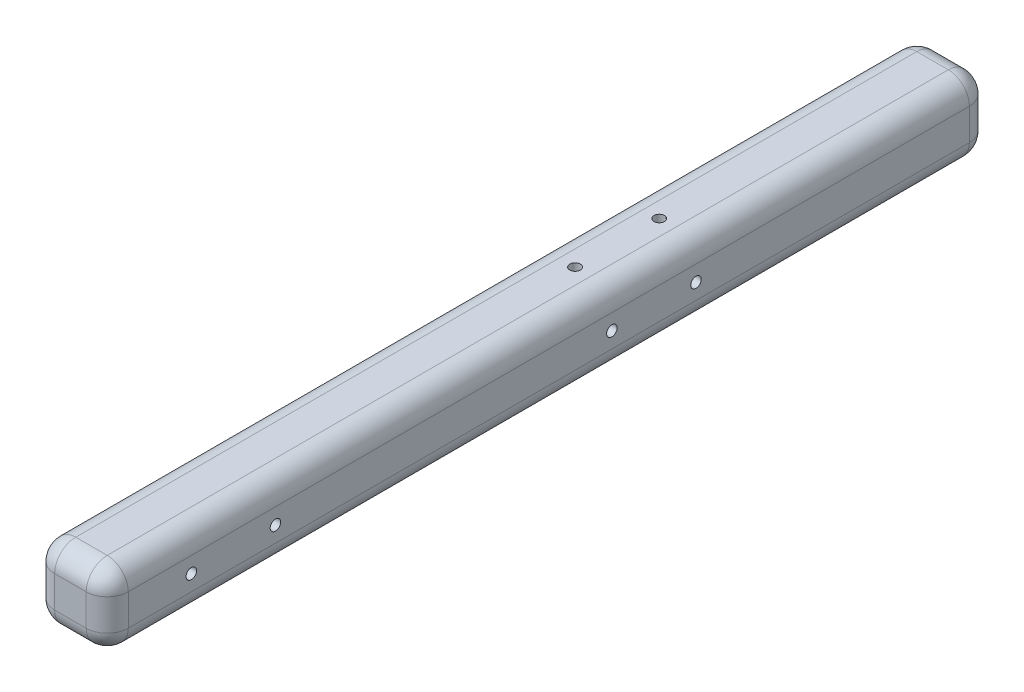
ISO-10303-21;
HEADER;
FILE_DESCRIPTION(('STEP AP214'),'2;1');
FILE_NAME('part.step','',(''),(''),'','','');
FILE_SCHEMA(('AUTOMOTIVE_DESIGN { 1 0 10303 214 1 1 1 1 }'));
ENDSEC;
DATA;
#1=APPLICATION_CONTEXT('core data for automotive mechanical design processes');
#2=APPLICATION_PROTOCOL_DEFINITION('international standard','automotive_design',2000,#1);
#3=PRODUCT_CONTEXT('',#1,'mechanical');
#4=PRODUCT('Part','Part','',(#3));
#5=PRODUCT_RELATED_PRODUCT_CATEGORY('part','',(#4));
#6=PRODUCT_DEFINITION_FORMATION('','',#4);
#7=PRODUCT_DEFINITION_CONTEXT('part definition',#1,'design');
#8=PRODUCT_DEFINITION('design','',#6,#7);
#9=PRODUCT_DEFINITION_SHAPE('','',#8);
#10=(LENGTH_UNIT() NAMED_UNIT(*) SI_UNIT(.MILLI.,.METRE.));
#11=(NAMED_UNIT(*) PLANE_ANGLE_UNIT() SI_UNIT($,.RADIAN.));
#12=(NAMED_UNIT(*) SI_UNIT($,.STERADIAN.) SOLID_ANGLE_UNIT());
#13=UNCERTAINTY_MEASURE_WITH_UNIT(LENGTH_MEASURE(1.E-05),#10,'distance_accuracy_value','');
#14=(GEOMETRIC_REPRESENTATION_CONTEXT(3) GLOBAL_UNCERTAINTY_ASSIGNED_CONTEXT((#13)) GLOBAL_UNIT_ASSIGNED_CONTEXT((#10,
#11,#12)) REPRESENTATION_CONTEXT('',''));
#15=CARTESIAN_POINT('',(0.,0.,0.));
#16=DIRECTION('',(0.,0.,1.));
#17=DIRECTION('',(1.,0.,0.));
#18=AXIS2_PLACEMENT_3D('',#15,#16,#17);
#19=CARTESIAN_POINT('',(-9.525,-9.525,254.));
#20=DIRECTION('',(0.,0.,-1.));
#21=DIRECTION('',(-1.,0.,0.));
#22=AXIS2_PLACEMENT_3D('',#19,#20,#21);
#23=CYLINDRICAL_SURFACE('',#22,12.7);
#24=DIRECTION('',(0.,0.,-1.));
#25=VECTOR('',#24,1.);
#26=CARTESIAN_POINT('',(-9.52499999999991,-22.225,254.));
#27=LINE('',#26,#25);
#28=CARTESIAN_POINT('',(-9.52499999999991,-22.225,520.7));
#29=VERTEX_POINT('',#28);
#30=CARTESIAN_POINT('',(-9.52499999999991,-22.225,12.7));
#31=VERTEX_POINT('',#30);
#32=EDGE_CURVE('E154',#29,#31,#27,.T.);
#33=ORIENTED_EDGE('',*,*,#32,.F.);
#34=CARTESIAN_POINT('',(-9.525,-9.525,520.7));
#35=DIRECTION('',(0.,0.,-1.));
#36=DIRECTION('',(-1.,0.,0.));
#37=AXIS2_PLACEMENT_3D('',#34,#35,#36);
#38=CIRCLE('',#37,12.7);
#39=CARTESIAN_POINT('',(-22.225,-9.52499999999991,520.7));
#40=VERTEX_POINT('',#39);
#41=EDGE_CURVE('E214',#29,#40,#38,.T.);
#42=ORIENTED_EDGE('',*,*,#41,.T.);
#43=DIRECTION('',(0.,0.,-1.));
#44=VECTOR('',#43,1.);
#45=CARTESIAN_POINT('',(-22.225,-9.52499999999991,254.));
#46=LINE('',#45,#44);
#47=CARTESIAN_POINT('',(-22.225,-9.52499999999991,12.7));
#48=VERTEX_POINT('',#47);
#49=EDGE_CURVE('E200',#40,#48,#46,.T.);
#50=ORIENTED_EDGE('',*,*,#49,.T.);
#51=CARTESIAN_POINT('',(-9.525,-9.525,12.7));
#52=DIRECTION('',(0.,0.,-1.));
#53=DIRECTION('',(-1.,0.,0.));
#54=AXIS2_PLACEMENT_3D('',#51,#52,#53);
#55=CIRCLE('',#54,12.7);
#56=EDGE_CURVE('E176',#48,#31,#55,.F.);
#57=ORIENTED_EDGE('',*,*,#56,.T.);
#58=EDGE_LOOP('',(#33,#42,#50,#57));
#59=FACE_BOUND('',#58,.T.);
#60=ADVANCED_FACE('F32',(#59),#23,.T.);
#61=CARTESIAN_POINT('',(-9.52499999999991,-22.225,254.));
#62=DIRECTION('',(0.,1.,0.));
#63=DIRECTION('',(0.,0.,1.));
#64=AXIS2_PLACEMENT_3D('',#61,#62,#63);
#65=PLANE('',#64);
#66=DIRECTION('',(0.,0.,-1.));
#67=VECTOR('',#66,1.);
#68=CARTESIAN_POINT('',(9.52499999999991,-22.225,254.));
#69=LINE('',#68,#67);
#70=CARTESIAN_POINT('',(9.52499999999991,-22.225,520.7));
#71=VERTEX_POINT('',#70);
#72=CARTESIAN_POINT('',(9.52499999999991,-22.225,12.7));
#73=VERTEX_POINT('',#72);
#74=EDGE_CURVE('E158',#71,#73,#69,.T.);
#75=ORIENTED_EDGE('',*,*,#74,.F.);
#76=DIRECTION('',(1.,0.,0.));
#77=VECTOR('',#76,1.);
#78=CARTESIAN_POINT('',(-9.52499999999991,-22.225,520.7));
#79=LINE('',#78,#77);
#80=EDGE_CURVE('E212',#71,#29,#79,.F.);
#81=ORIENTED_EDGE('',*,*,#80,.T.);
#82=ORIENTED_EDGE('',*,*,#32,.T.);
#83=DIRECTION('',(1.,0.,0.));
#84=VECTOR('',#83,1.);
#85=CARTESIAN_POINT('',(9.52499999999991,-22.225,12.7));
#86=LINE('',#85,#84);
#87=EDGE_CURVE('E173',#31,#73,#86,.T.);
#88=ORIENTED_EDGE('',*,*,#87,.T.);
#89=EDGE_LOOP('',(#75,#81,#82,#88));
#90=FACE_BOUND('',#89,.T.);
#91=ADVANCED_FACE('F287',(#90),#65,.F.);
#92=CARTESIAN_POINT('',(9.525,-9.525,254.));
#93=DIRECTION('',(0.,0.,-1.));
#94=DIRECTION('',(-1.,0.,0.));
#95=AXIS2_PLACEMENT_3D('',#92,#93,#94);
#96=CYLINDRICAL_SURFACE('',#95,12.7);
#97=DIRECTION('',(0.,0.,-1.));
#98=VECTOR('',#97,1.);
#99=CARTESIAN_POINT('',(22.225,-9.52499999999991,254.));
#100=LINE('',#99,#98);
#101=CARTESIAN_POINT('',(22.225,-9.52499999999991,520.7));
#102=VERTEX_POINT('',#101);
#103=CARTESIAN_POINT('',(22.225,-9.52499999999991,12.7));
#104=VERTEX_POINT('',#103);
#105=EDGE_CURVE('E276',#102,#104,#100,.T.);
#106=ORIENTED_EDGE('',*,*,#105,.F.);
#107=CARTESIAN_POINT('',(9.525,-9.525,520.7));
#108=DIRECTION('',(0.,0.,-1.));
#109=DIRECTION('',(-1.,0.,0.));
#110=AXIS2_PLACEMENT_3D('',#107,#108,#109);
#111=CIRCLE('',#110,12.7);
#112=EDGE_CURVE('E148',#102,#71,#111,.T.);
#113=ORIENTED_EDGE('',*,*,#112,.T.);
#114=ORIENTED_EDGE('',*,*,#74,.T.);
#115=CARTESIAN_POINT('',(9.525,-9.525,12.7));
#116=DIRECTION('',(0.,0.,-1.));
#117=DIRECTION('',(-1.,0.,0.));
#118=AXIS2_PLACEMENT_3D('',#115,#116,#117);
#119=CIRCLE('',#118,12.7);
#120=EDGE_CURVE('E170',#73,#104,#119,.F.);
#121=ORIENTED_EDGE('',*,*,#120,.T.);
#122=EDGE_LOOP('',(#106,#113,#114,#121));
#123=FACE_BOUND('',#122,.T.);
#124=ADVANCED_FACE('F280',(#123),#96,.T.);
#125=CARTESIAN_POINT('',(22.225,-9.52499999999991,254.));
#126=DIRECTION('',(-1.,0.,0.));
#127=DIRECTION('',(0.,0.,1.));
#128=AXIS2_PLACEMENT_3D('',#125,#126,#127);
#129=PLANE('',#128);
#130=CARTESIAN_POINT('',(22.225,0.,431.800000000005));
#131=DIRECTION('',(1.,0.,0.));
#132=DIRECTION('',(0.,0.,-1.));
#133=AXIS2_PLACEMENT_3D('',#130,#131,#132);
#134=CIRCLE('',#133,3.17499999999997);
#135=CARTESIAN_POINT('',(22.225,0.,428.625000000005));
#136=VERTEX_POINT('',#135);
#137=EDGE_CURVE('E721',#136,#136,#134,.T.);
#138=ORIENTED_EDGE('',*,*,#137,.F.);
#139=EDGE_LOOP('',(#138));
#140=FACE_BOUND('',#139,.T.);
#141=CARTESIAN_POINT('',(22.225,0.,482.599999999995));
#142=DIRECTION('',(1.,0.,0.));
#143=DIRECTION('',(0.,0.,-1.));
#144=AXIS2_PLACEMENT_3D('',#141,#142,#143);
#145=CIRCLE('',#144,3.17499999999997);
#146=CARTESIAN_POINT('',(22.225,0.,479.424999999995));
#147=VERTEX_POINT('',#146);
#148=EDGE_CURVE('E715',#147,#147,#145,.T.);
#149=ORIENTED_EDGE('',*,*,#148,.F.);
#150=EDGE_LOOP('',(#149));
#151=FACE_BOUND('',#150,.T.);
#152=CARTESIAN_POINT('',(22.2250000000006,6.01007305568305E-13,177.799999999995));
#153=DIRECTION('',(1.,0.,0.));
#154=DIRECTION('',(0.,0.,1.));
#155=AXIS2_PLACEMENT_3D('',#152,#153,#154);
#156=CIRCLE('',#155,3.175);
#157=CARTESIAN_POINT('',(22.2250000000006,6.12092758819132E-13,180.974999999995));
#158=VERTEX_POINT('',#157);
#159=EDGE_CURVE('E255',#158,#158,#156,.T.);
#160=ORIENTED_EDGE('',*,*,#159,.F.);
#161=EDGE_LOOP('',(#160));
#162=FACE_BOUND('',#161,.T.);
#163=CARTESIAN_POINT('',(22.2250000000008,6.89690931574916E-13,228.6));
#164=DIRECTION('',(1.,0.,0.));
#165=DIRECTION('',(0.,0.,1.));
#166=AXIS2_PLACEMENT_3D('',#163,#164,#165);
#167=CIRCLE('',#166,3.175);
#168=CARTESIAN_POINT('',(22.2250000000008,7.00776384825743E-13,231.775));
#169=VERTEX_POINT('',#168);
#170=EDGE_CURVE('E245',#169,#169,#167,.T.);
#171=ORIENTED_EDGE('',*,*,#170,.F.);
#172=EDGE_LOOP('',(#171));
#173=FACE_BOUND('',#172,.T.);
#174=DIRECTION('',(0.,0.,-1.));
#175=VECTOR('',#174,1.);
#176=CARTESIAN_POINT('',(22.225,9.52499999999991,254.));
#177=LINE('',#176,#175);
#178=CARTESIAN_POINT('',(22.225,9.52499999999991,520.7));
#179=VERTEX_POINT('',#178);
#180=CARTESIAN_POINT('',(22.225,9.52499999999991,12.7));
#181=VERTEX_POINT('',#180);
#182=EDGE_CURVE('E128',#179,#181,#177,.T.);
#183=ORIENTED_EDGE('',*,*,#182,.F.);
#184=DIRECTION('',(0.,1.,0.));
#185=VECTOR('',#184,1.);
#186=CARTESIAN_POINT('',(22.225,-9.52499999999991,520.7));
#187=LINE('',#186,#185);
#188=EDGE_CURVE('E11',#179,#102,#187,.F.);
#189=ORIENTED_EDGE('',*,*,#188,.T.);
#190=ORIENTED_EDGE('',*,*,#105,.T.);
#191=DIRECTION('',(0.,1.,0.));
#192=VECTOR('',#191,1.);
#193=CARTESIAN_POINT('',(22.225,9.52499999999991,12.7));
#194=LINE('',#193,#192);
#195=EDGE_CURVE('E153',#104,#181,#194,.T.);
#196=ORIENTED_EDGE('',*,*,#195,.T.);
#197=EDGE_LOOP('',(#183,#189,#190,#196));
#198=FACE_BOUND('',#197,.T.);
#199=ADVANCED_FACE('F299',(#140,#151,#162,#173,#198),#129,.F.);
#200=CARTESIAN_POINT('',(9.525,9.525,254.));
#201=DIRECTION('',(0.,0.,-1.));
#202=DIRECTION('',(-1.,0.,0.));
#203=AXIS2_PLACEMENT_3D('',#200,#201,#202);
#204=CYLINDRICAL_SURFACE('',#203,12.7);
#205=DIRECTION('',(0.,0.,-1.));
#206=VECTOR('',#205,1.);
#207=CARTESIAN_POINT('',(9.52499999999991,22.225,254.));
#208=LINE('',#207,#206);
#209=CARTESIAN_POINT('',(9.52499999999991,22.225,520.7));
#210=VERTEX_POINT('',#209);
#211=CARTESIAN_POINT('',(9.52499999999991,22.225,12.7));
#212=VERTEX_POINT('',#211);
#213=EDGE_CURVE('E120',#210,#212,#208,.T.);
#214=ORIENTED_EDGE('',*,*,#213,.F.);
#215=CARTESIAN_POINT('',(9.525,9.525,520.7));
#216=DIRECTION('',(0.,0.,-1.));
#217=DIRECTION('',(-1.,0.,0.));
#218=AXIS2_PLACEMENT_3D('',#215,#216,#217);
#219=CIRCLE('',#218,12.7);
#220=EDGE_CURVE('E41',#210,#179,#219,.T.);
#221=ORIENTED_EDGE('',*,*,#220,.T.);
#222=ORIENTED_EDGE('',*,*,#182,.T.);
#223=CARTESIAN_POINT('',(9.525,9.525,12.7));
#224=DIRECTION('',(0.,0.,-1.));
#225=DIRECTION('',(-1.,0.,0.));
#226=AXIS2_PLACEMENT_3D('',#223,#224,#225);
#227=CIRCLE('',#226,12.7);
#228=EDGE_CURVE('E137',#181,#212,#227,.F.);
#229=ORIENTED_EDGE('',*,*,#228,.T.);
#230=EDGE_LOOP('',(#214,#221,#222,#229));
#231=FACE_BOUND('',#230,.T.);
#232=ADVANCED_FACE('F151',(#231),#204,.T.);
#233=CARTESIAN_POINT('',(-9.52499999999991,22.225,254.));
#234=DIRECTION('',(0.,-1.,0.));
#235=DIRECTION('',(0.,0.,-1.));
#236=AXIS2_PLACEMENT_3D('',#233,#234,#235);
#237=PLANE('',#236);
#238=CARTESIAN_POINT('',(0.,22.225,177.799999999995));
#239=DIRECTION('',(0.,1.,0.));
#240=DIRECTION('',(0.,0.,1.));
#241=AXIS2_PLACEMENT_3D('',#238,#239,#240);
#242=CIRCLE('',#241,3.175);
#243=CARTESIAN_POINT('',(0.,22.225,180.974999999995));
#244=VERTEX_POINT('',#243);
#245=EDGE_CURVE('E261',#244,#244,#242,.T.);
#246=ORIENTED_EDGE('',*,*,#245,.F.);
#247=EDGE_LOOP('',(#246));
#248=FACE_BOUND('',#247,.T.);
#249=CARTESIAN_POINT('',(0.,22.225,228.6));
#250=DIRECTION('',(0.,1.,0.));
#251=DIRECTION('',(0.,0.,1.));
#252=AXIS2_PLACEMENT_3D('',#249,#250,#251);
#253=CIRCLE('',#252,3.175);
#254=CARTESIAN_POINT('',(0.,22.225,231.775));
#255=VERTEX_POINT('',#254);
#256=EDGE_CURVE('E267',#255,#255,#253,.T.);
#257=ORIENTED_EDGE('',*,*,#256,.F.);
#258=EDGE_LOOP('',(#257));
#259=FACE_BOUND('',#258,.T.);
#260=DIRECTION('',(0.,0.,-1.));
#261=VECTOR('',#260,1.);
#262=CARTESIAN_POINT('',(-9.52499999999991,22.225,254.));
#263=LINE('',#262,#261);
#264=CARTESIAN_POINT('',(-9.52499999999991,22.225,520.7));
#265=VERTEX_POINT('',#264);
#266=CARTESIAN_POINT('',(-9.52499999999991,22.225,12.7));
#267=VERTEX_POINT('',#266);
#268=EDGE_CURVE('E129',#265,#267,#263,.T.);
#269=ORIENTED_EDGE('',*,*,#268,.F.);
#270=DIRECTION('',(-1.,0.,0.));
#271=VECTOR('',#270,1.);
#272=CARTESIAN_POINT('',(-9.52499999999991,22.225,520.7));
#273=LINE('',#272,#271);
#274=EDGE_CURVE('E56',#265,#210,#273,.F.);
#275=ORIENTED_EDGE('',*,*,#274,.T.);
#276=ORIENTED_EDGE('',*,*,#213,.T.);
#277=DIRECTION('',(-1.,0.,0.));
#278=VECTOR('',#277,1.);
#279=CARTESIAN_POINT('',(-9.52499999999991,22.225,12.7));
#280=LINE('',#279,#278);
#281=EDGE_CURVE('E124',#212,#267,#280,.T.);
#282=ORIENTED_EDGE('',*,*,#281,.T.);
#283=EDGE_LOOP('',(#269,#275,#276,#282));
#284=FACE_BOUND('',#283,.T.);
#285=ADVANCED_FACE('F122',(#248,#259,#284),#237,.F.);
#286=CARTESIAN_POINT('',(-9.525,9.525,254.));
#287=DIRECTION('',(0.,0.,-1.));
#288=DIRECTION('',(-1.,0.,0.));
#289=AXIS2_PLACEMENT_3D('',#286,#287,#288);
#290=CYLINDRICAL_SURFACE('',#289,12.7);
#291=DIRECTION('',(0.,0.,-1.));
#292=VECTOR('',#291,1.);
#293=CARTESIAN_POINT('',(-22.225,9.52499999999991,254.));
#294=LINE('',#293,#292);
#295=CARTESIAN_POINT('',(-22.225,9.52499999999991,520.7));
#296=VERTEX_POINT('',#295);
#297=CARTESIAN_POINT('',(-22.225,9.52499999999991,12.7));
#298=VERTEX_POINT('',#297);
#299=EDGE_CURVE('E272',#296,#298,#294,.T.);
#300=ORIENTED_EDGE('',*,*,#299,.F.);
#301=CARTESIAN_POINT('',(-9.525,9.525,520.7));
#302=DIRECTION('',(0.,0.,-1.));
#303=DIRECTION('',(-1.,0.,0.));
#304=AXIS2_PLACEMENT_3D('',#301,#302,#303);
#305=CIRCLE('',#304,12.7);
#306=EDGE_CURVE('E218',#296,#265,#305,.T.);
#307=ORIENTED_EDGE('',*,*,#306,.T.);
#308=ORIENTED_EDGE('',*,*,#268,.T.);
#309=CARTESIAN_POINT('',(-9.525,9.525,12.7));
#310=DIRECTION('',(0.,0.,-1.));
#311=DIRECTION('',(-1.,0.,0.));
#312=AXIS2_PLACEMENT_3D('',#309,#310,#311);
#313=CIRCLE('',#312,12.7);
#314=EDGE_CURVE('E149',#267,#298,#313,.F.);
#315=ORIENTED_EDGE('',*,*,#314,.T.);
#316=EDGE_LOOP('',(#300,#307,#308,#315));
#317=FACE_BOUND('',#316,.T.);
#318=ADVANCED_FACE('F330',(#317),#290,.T.);
#319=CARTESIAN_POINT('',(-22.225,-9.52499999999991,254.));
#320=DIRECTION('',(1.,0.,0.));
#321=DIRECTION('',(0.,0.,-1.));
#322=AXIS2_PLACEMENT_3D('',#319,#320,#321);
#323=PLANE('',#322);
#324=ORIENTED_EDGE('',*,*,#49,.F.);
#325=DIRECTION('',(0.,-1.,0.));
#326=VECTOR('',#325,1.);
#327=CARTESIAN_POINT('',(-22.225,-9.52499999999991,520.7));
#328=LINE('',#327,#326);
#329=EDGE_CURVE('E216',#40,#296,#328,.F.);
#330=ORIENTED_EDGE('',*,*,#329,.T.);
#331=ORIENTED_EDGE('',*,*,#299,.T.);
#332=DIRECTION('',(0.,-1.,0.));
#333=VECTOR('',#332,1.);
#334=CARTESIAN_POINT('',(-22.225,-9.52499999999991,12.7));
#335=LINE('',#334,#333);
#336=EDGE_CURVE('E179',#298,#48,#335,.T.);
#337=ORIENTED_EDGE('',*,*,#336,.T.);
#338=EDGE_LOOP('',(#324,#330,#331,#337));
#339=FACE_BOUND('',#338,.T.);
#340=ADVANCED_FACE('F327',(#339),#323,.F.);
#341=CARTESIAN_POINT('',(-9.525,-9.525,0.));
#342=DIRECTION('',(0.,0.,-1.));
#343=DIRECTION('',(-1.,0.,0.));
#344=AXIS2_PLACEMENT_3D('',#341,#342,#343);
#345=PLANE('',#344);
#346=DIRECTION('',(-1.,0.,0.));
#347=VECTOR('',#346,1.);
#348=CARTESIAN_POINT('',(9.52499999999991,9.525,0.));
#349=LINE('',#348,#347);
#350=CARTESIAN_POINT('',(-9.525,9.525,0.));
#351=VERTEX_POINT('',#350);
#352=CARTESIAN_POINT('',(9.525,9.525,0.));
#353=VERTEX_POINT('',#352);
#354=EDGE_CURVE('E156',#351,#353,#349,.F.);
#355=ORIENTED_EDGE('',*,*,#354,.T.);
#356=DIRECTION('',(0.,1.,0.));
#357=VECTOR('',#356,1.);
#358=CARTESIAN_POINT('',(9.525,-9.52499999999991,0.));
#359=LINE('',#358,#357);
#360=CARTESIAN_POINT('',(9.525,-9.525,0.));
#361=VERTEX_POINT('',#360);
#362=EDGE_CURVE('E167',#353,#361,#359,.F.);
#363=ORIENTED_EDGE('',*,*,#362,.T.);
#364=DIRECTION('',(1.,0.,0.));
#365=VECTOR('',#364,1.);
#366=CARTESIAN_POINT('',(-9.52499999999991,-9.525,0.));
#367=LINE('',#366,#365);
#368=CARTESIAN_POINT('',(-9.525,-9.525,0.));
#369=VERTEX_POINT('',#368);
#370=EDGE_CURVE('E165',#361,#369,#367,.F.);
#371=ORIENTED_EDGE('',*,*,#370,.T.);
#372=DIRECTION('',(0.,-1.,0.));
#373=VECTOR('',#372,1.);
#374=CARTESIAN_POINT('',(-9.525,9.52499999999992,0.));
#375=LINE('',#374,#373);
#376=EDGE_CURVE('E163',#369,#351,#375,.F.);
#377=ORIENTED_EDGE('',*,*,#376,.T.);
#378=EDGE_LOOP('',(#355,#363,#371,#377));
#379=FACE_BOUND('',#378,.T.);
#380=ADVANCED_FACE('F374',(#379),#345,.T.);
#381=CARTESIAN_POINT('',(-9.525,-9.525,12.7));
#382=DIRECTION('',(0.,0.,-1.));
#383=DIRECTION('',(-1.,0.,0.));
#384=AXIS2_PLACEMENT_3D('',#381,#382,#383);
#385=SPHERICAL_SURFACE('',#384,12.7);
#386=CARTESIAN_POINT('',(-9.525,-9.525,12.7));
#387=DIRECTION('',(0.,1.,0.));
#388=DIRECTION('',(-1.,0.,0.));
#389=AXIS2_PLACEMENT_3D('',#386,#387,#388);
#390=CIRCLE('',#389,12.7);
#391=EDGE_CURVE('E194',#369,#48,#390,.T.);
#392=ORIENTED_EDGE('',*,*,#391,.F.);
#393=CARTESIAN_POINT('',(-9.525,-9.525,12.7));
#394=DIRECTION('',(1.,0.,0.));
#395=DIRECTION('',(0.,1.,0.));
#396=AXIS2_PLACEMENT_3D('',#393,#394,#395);
#397=CIRCLE('',#396,12.7);
#398=EDGE_CURVE('E197',#31,#369,#397,.T.);
#399=ORIENTED_EDGE('',*,*,#398,.F.);
#400=ORIENTED_EDGE('',*,*,#56,.F.);
#401=EDGE_LOOP('',(#392,#399,#400));
#402=FACE_BOUND('',#401,.T.);
#403=ADVANCED_FACE('F371',(#402),#385,.T.);
#404=CARTESIAN_POINT('',(-9.52499999999991,-9.525,12.7));
#405=DIRECTION('',(-1.,0.,0.));
#406=DIRECTION('',(0.,0.,1.));
#407=AXIS2_PLACEMENT_3D('',#404,#405,#406);
#408=CYLINDRICAL_SURFACE('',#407,12.7);
#409=ORIENTED_EDGE('',*,*,#398,.T.);
#410=ORIENTED_EDGE('',*,*,#370,.F.);
#411=CARTESIAN_POINT('',(9.52499999999991,-9.525,12.7));
#412=DIRECTION('',(1.,0.,0.));
#413=DIRECTION('',(0.,0.,-1.));
#414=AXIS2_PLACEMENT_3D('',#411,#412,#413);
#415=CIRCLE('',#414,12.7);
#416=EDGE_CURVE('E191',#73,#361,#415,.T.);
#417=ORIENTED_EDGE('',*,*,#416,.F.);
#418=ORIENTED_EDGE('',*,*,#87,.F.);
#419=EDGE_LOOP('',(#409,#410,#417,#418));
#420=FACE_BOUND('',#419,.T.);
#421=ADVANCED_FACE('F291',(#420),#408,.T.);
#422=CARTESIAN_POINT('',(-9.525,-9.52499999999991,12.7));
#423=DIRECTION('',(0.,1.,0.));
#424=DIRECTION('',(0.,0.,1.));
#425=AXIS2_PLACEMENT_3D('',#422,#423,#424);
#426=CYLINDRICAL_SURFACE('',#425,12.7);
#427=ORIENTED_EDGE('',*,*,#391,.T.);
#428=ORIENTED_EDGE('',*,*,#336,.F.);
#429=CARTESIAN_POINT('',(-9.525,9.52499999999991,12.7));
#430=DIRECTION('',(0.,1.,0.));
#431=DIRECTION('',(0.,0.,1.));
#432=AXIS2_PLACEMENT_3D('',#429,#430,#431);
#433=CIRCLE('',#432,12.7);
#434=EDGE_CURVE('E188',#351,#298,#433,.T.);
#435=ORIENTED_EDGE('',*,*,#434,.F.);
#436=ORIENTED_EDGE('',*,*,#376,.F.);
#437=EDGE_LOOP('',(#427,#428,#435,#436));
#438=FACE_BOUND('',#437,.T.);
#439=ADVANCED_FACE('F365',(#438),#426,.T.);
#440=CARTESIAN_POINT('',(9.525,-9.525,12.7));
#441=DIRECTION('',(0.,0.,-1.));
#442=DIRECTION('',(-1.,0.,0.));
#443=AXIS2_PLACEMENT_3D('',#440,#441,#442);
#444=SPHERICAL_SURFACE('',#443,12.7);
#445=ORIENTED_EDGE('',*,*,#120,.F.);
#446=ORIENTED_EDGE('',*,*,#416,.T.);
#447=CARTESIAN_POINT('',(9.525,-9.525,12.7));
#448=DIRECTION('',(0.,1.,0.));
#449=DIRECTION('',(-1.,0.,0.));
#450=AXIS2_PLACEMENT_3D('',#447,#448,#449);
#451=CIRCLE('',#450,12.7);
#452=EDGE_CURVE('E186',#104,#361,#451,.T.);
#453=ORIENTED_EDGE('',*,*,#452,.F.);
#454=EDGE_LOOP('',(#445,#446,#453));
#455=FACE_BOUND('',#454,.T.);
#456=ADVANCED_FACE('F293',(#455),#444,.T.);
#457=CARTESIAN_POINT('',(-9.525,9.525,12.7));
#458=DIRECTION('',(0.,0.,-1.));
#459=DIRECTION('',(-1.,0.,0.));
#460=AXIS2_PLACEMENT_3D('',#457,#458,#459);
#461=SPHERICAL_SURFACE('',#460,12.7);
#462=ORIENTED_EDGE('',*,*,#434,.T.);
#463=ORIENTED_EDGE('',*,*,#314,.F.);
#464=CARTESIAN_POINT('',(-9.525,9.525,12.7));
#465=DIRECTION('',(1.,0.,0.));
#466=DIRECTION('',(0.,1.,0.));
#467=AXIS2_PLACEMENT_3D('',#464,#465,#466);
#468=CIRCLE('',#467,12.7);
#469=EDGE_CURVE('E147',#351,#267,#468,.T.);
#470=ORIENTED_EDGE('',*,*,#469,.F.);
#471=EDGE_LOOP('',(#462,#463,#470));
#472=FACE_BOUND('',#471,.T.);
#473=ADVANCED_FACE('F359',(#472),#461,.T.);
#474=CARTESIAN_POINT('',(9.525,-9.52499999999991,12.7));
#475=DIRECTION('',(0.,-1.,0.));
#476=DIRECTION('',(0.,0.,-1.));
#477=AXIS2_PLACEMENT_3D('',#474,#475,#476);
#478=CYLINDRICAL_SURFACE('',#477,12.7);
#479=ORIENTED_EDGE('',*,*,#452,.T.);
#480=ORIENTED_EDGE('',*,*,#362,.F.);
#481=CARTESIAN_POINT('',(9.525,9.52499999999991,12.7));
#482=DIRECTION('',(0.,1.,0.));
#483=DIRECTION('',(0.,0.,1.));
#484=AXIS2_PLACEMENT_3D('',#481,#482,#483);
#485=CIRCLE('',#484,12.7);
#486=EDGE_CURVE('E139',#181,#353,#485,.T.);
#487=ORIENTED_EDGE('',*,*,#486,.F.);
#488=ORIENTED_EDGE('',*,*,#195,.F.);
#489=EDGE_LOOP('',(#479,#480,#487,#488));
#490=FACE_BOUND('',#489,.T.);
#491=ADVANCED_FACE('F297',(#490),#478,.T.);
#492=CARTESIAN_POINT('',(-9.52499999999991,9.525,12.7));
#493=DIRECTION('',(1.,0.,0.));
#494=DIRECTION('',(0.,0.,-1.));
#495=AXIS2_PLACEMENT_3D('',#492,#493,#494);
#496=CYLINDRICAL_SURFACE('',#495,12.7);
#497=ORIENTED_EDGE('',*,*,#469,.T.);
#498=ORIENTED_EDGE('',*,*,#281,.F.);
#499=CARTESIAN_POINT('',(9.525,9.525,12.7));
#500=DIRECTION('',(1.,0.,0.));
#501=DIRECTION('',(0.,1.,0.));
#502=AXIS2_PLACEMENT_3D('',#499,#500,#501);
#503=CIRCLE('',#502,12.7);
#504=EDGE_CURVE('E135',#353,#212,#503,.T.);
#505=ORIENTED_EDGE('',*,*,#504,.F.);
#506=ORIENTED_EDGE('',*,*,#354,.F.);
#507=EDGE_LOOP('',(#497,#498,#505,#506));
#508=FACE_BOUND('',#507,.T.);
#509=ADVANCED_FACE('F145',(#508),#496,.T.);
#510=CARTESIAN_POINT('',(9.525,9.525,12.7));
#511=DIRECTION('',(0.,0.,-1.));
#512=DIRECTION('',(-1.,0.,0.));
#513=AXIS2_PLACEMENT_3D('',#510,#511,#512);
#514=SPHERICAL_SURFACE('',#513,12.7);
#515=ORIENTED_EDGE('',*,*,#228,.F.);
#516=ORIENTED_EDGE('',*,*,#486,.T.);
#517=ORIENTED_EDGE('',*,*,#504,.T.);
#518=EDGE_LOOP('',(#515,#516,#517));
#519=FACE_BOUND('',#518,.T.);
#520=ADVANCED_FACE('F136',(#519),#514,.T.);
#521=CARTESIAN_POINT('',(0.,9.525,228.6));
#522=DIRECTION('',(0.,1.,0.));
#523=DIRECTION('',(0.,0.,1.));
#524=AXIS2_PLACEMENT_3D('',#521,#522,#523);
#525=CYLINDRICAL_SURFACE('',#524,3.175);
#526=CARTESIAN_POINT('',(0.,9.525,228.6));
#527=DIRECTION('',(0.,1.,0.));
#528=DIRECTION('',(0.,0.,1.));
#529=AXIS2_PLACEMENT_3D('',#526,#527,#528);
#530=CIRCLE('',#529,3.175);
#531=CARTESIAN_POINT('',(0.,9.525,231.775));
#532=VERTEX_POINT('',#531);
#533=EDGE_CURVE('E264',#532,#532,#530,.T.);
#534=ORIENTED_EDGE('',*,*,#533,.F.);
#535=EDGE_LOOP('',(#534));
#536=FACE_BOUND('',#535,.T.);
#537=ORIENTED_EDGE('',*,*,#256,.T.);
#538=EDGE_LOOP('',(#537));
#539=FACE_BOUND('',#538,.T.);
#540=ADVANCED_FACE('F354',(#536,#539),#525,.F.);
#541=CARTESIAN_POINT('',(0.,9.525,228.6));
#542=DIRECTION('',(0.,1.,0.));
#543=DIRECTION('',(0.,0.,1.));
#544=AXIS2_PLACEMENT_3D('',#541,#542,#543);
#545=PLANE('',#544);
#546=ORIENTED_EDGE('',*,*,#533,.T.);
#547=EDGE_LOOP('',(#546));
#548=FACE_BOUND('',#547,.T.);
#549=ADVANCED_FACE('F601',(#548),#545,.T.);
#550=CARTESIAN_POINT('',(0.,9.525,177.799999999995));
#551=DIRECTION('',(0.,1.,0.));
#552=DIRECTION('',(0.,0.,1.));
#553=AXIS2_PLACEMENT_3D('',#550,#551,#552);
#554=CYLINDRICAL_SURFACE('',#553,3.175);
#555=CARTESIAN_POINT('',(0.,9.525,177.799999999995));
#556=DIRECTION('',(0.,1.,0.));
#557=DIRECTION('',(0.,0.,1.));
#558=AXIS2_PLACEMENT_3D('',#555,#556,#557);
#559=CIRCLE('',#558,3.175);
#560=CARTESIAN_POINT('',(0.,9.525,180.974999999995));
#561=VERTEX_POINT('',#560);
#562=EDGE_CURVE('E142',#561,#561,#559,.T.);
#563=ORIENTED_EDGE('',*,*,#562,.F.);
#564=EDGE_LOOP('',(#563));
#565=FACE_BOUND('',#564,.T.);
#566=ORIENTED_EDGE('',*,*,#245,.T.);
#567=EDGE_LOOP('',(#566));
#568=FACE_BOUND('',#567,.T.);
#569=ADVANCED_FACE('F592',(#565,#568),#554,.F.);
#570=CARTESIAN_POINT('',(0.,9.525,177.799999999995));
#571=DIRECTION('',(0.,1.,0.));
#572=DIRECTION('',(0.,0.,1.));
#573=AXIS2_PLACEMENT_3D('',#570,#571,#572);
#574=PLANE('',#573);
#575=ORIENTED_EDGE('',*,*,#562,.T.);
#576=EDGE_LOOP('',(#575));
#577=FACE_BOUND('',#576,.T.);
#578=ADVANCED_FACE('F583',(#577),#574,.T.);
#579=CARTESIAN_POINT('',(9.5250000000008,7.34032744578224E-13,228.6));
#580=DIRECTION('',(1.,0.,0.));
#581=DIRECTION('',(0.,1.,0.));
#582=AXIS2_PLACEMENT_3D('',#579,#580,#581);
#583=CYLINDRICAL_SURFACE('',#582,3.175);
#584=CARTESIAN_POINT('',(9.5250000000008,7.34032744578224E-13,228.6));
#585=DIRECTION('',(1.,0.,0.));
#586=DIRECTION('',(0.,0.,1.));
#587=AXIS2_PLACEMENT_3D('',#584,#585,#586);
#588=CIRCLE('',#587,3.175);
#589=CARTESIAN_POINT('',(9.52500000000081,7.45118197829051E-13,231.775));
#590=VERTEX_POINT('',#589);
#591=EDGE_CURVE('E250',#590,#590,#588,.T.);
#592=ORIENTED_EDGE('',*,*,#591,.F.);
#593=EDGE_LOOP('',(#592));
#594=FACE_BOUND('',#593,.T.);
#595=ORIENTED_EDGE('',*,*,#170,.T.);
#596=EDGE_LOOP('',(#595));
#597=FACE_BOUND('',#596,.T.);
#598=ADVANCED_FACE('F574',(#594,#597),#583,.F.);
#599=CARTESIAN_POINT('',(9.5250000000008,7.34032744578224E-13,228.6));
#600=DIRECTION('',(1.,0.,0.));
#601=DIRECTION('',(0.,0.,1.));
#602=AXIS2_PLACEMENT_3D('',#599,#600,#601);
#603=PLANE('',#602);
#604=ORIENTED_EDGE('',*,*,#591,.T.);
#605=EDGE_LOOP('',(#604));
#606=FACE_BOUND('',#605,.T.);
#607=ADVANCED_FACE('F565',(#606),#603,.T.);
#608=CARTESIAN_POINT('',(9.52500000000062,6.45349118571612E-13,177.799999999995));
#609=DIRECTION('',(1.,0.,0.));
#610=DIRECTION('',(0.,1.,0.));
#611=AXIS2_PLACEMENT_3D('',#608,#609,#610);
#612=CYLINDRICAL_SURFACE('',#611,3.175);
#613=CARTESIAN_POINT('',(9.52500000000062,6.45349118571612E-13,177.799999999995));
#614=DIRECTION('',(1.,0.,0.));
#615=DIRECTION('',(0.,0.,1.));
#616=AXIS2_PLACEMENT_3D('',#613,#614,#615);
#617=CIRCLE('',#616,3.175);
#618=CARTESIAN_POINT('',(9.52500000000063,6.56434571822439E-13,180.974999999995));
#619=VERTEX_POINT('',#618);
#620=EDGE_CURVE('E270',#619,#619,#617,.T.);
#621=ORIENTED_EDGE('',*,*,#620,.F.);
#622=EDGE_LOOP('',(#621));
#623=FACE_BOUND('',#622,.T.);
#624=ORIENTED_EDGE('',*,*,#159,.T.);
#625=EDGE_LOOP('',(#624));
#626=FACE_BOUND('',#625,.T.);
#627=ADVANCED_FACE('F556',(#623,#626),#612,.F.);
#628=CARTESIAN_POINT('',(9.52500000000062,6.45349118571612E-13,177.799999999995));
#629=DIRECTION('',(1.,0.,0.));
#630=DIRECTION('',(0.,0.,1.));
#631=AXIS2_PLACEMENT_3D('',#628,#629,#630);
#632=PLANE('',#631);
#633=ORIENTED_EDGE('',*,*,#620,.T.);
#634=EDGE_LOOP('',(#633));
#635=FACE_BOUND('',#634,.T.);
#636=ADVANCED_FACE('F472',(#635),#632,.T.);
#637=CARTESIAN_POINT('',(-9.525,-9.525,533.4));
#638=DIRECTION('',(0.,0.,-1.));
#639=DIRECTION('',(-1.,0.,0.));
#640=AXIS2_PLACEMENT_3D('',#637,#638,#639);
#641=PLANE('',#640);
#642=DIRECTION('',(0.,-1.,0.));
#643=VECTOR('',#642,1.);
#644=CARTESIAN_POINT('',(-9.525,-9.525,533.4));
#645=LINE('',#644,#643);
#646=CARTESIAN_POINT('',(-9.525,9.525,533.4));
#647=VERTEX_POINT('',#646);
#648=CARTESIAN_POINT('',(-9.525,-9.525,533.4));
#649=VERTEX_POINT('',#648);
#650=EDGE_CURVE('E207',#647,#649,#645,.T.);
#651=ORIENTED_EDGE('',*,*,#650,.T.);
#652=DIRECTION('',(1.,0.,0.));
#653=VECTOR('',#652,1.);
#654=CARTESIAN_POINT('',(-9.525,-9.525,533.4));
#655=LINE('',#654,#653);
#656=CARTESIAN_POINT('',(9.525,-9.525,533.4));
#657=VERTEX_POINT('',#656);
#658=EDGE_CURVE('E209',#649,#657,#655,.T.);
#659=ORIENTED_EDGE('',*,*,#658,.T.);
#660=DIRECTION('',(0.,1.,0.));
#661=VECTOR('',#660,1.);
#662=CARTESIAN_POINT('',(9.525,-9.525,533.4));
#663=LINE('',#662,#661);
#664=CARTESIAN_POINT('',(9.525,9.525,533.4));
#665=VERTEX_POINT('',#664);
#666=EDGE_CURVE('E203',#657,#665,#663,.T.);
#667=ORIENTED_EDGE('',*,*,#666,.T.);
#668=DIRECTION('',(-1.,0.,0.));
#669=VECTOR('',#668,1.);
#670=CARTESIAN_POINT('',(-9.525,9.525,533.4));
#671=LINE('',#670,#669);
#672=EDGE_CURVE('E205',#665,#647,#671,.T.);
#673=ORIENTED_EDGE('',*,*,#672,.T.);
#674=EDGE_LOOP('',(#651,#659,#667,#673));
#675=FACE_BOUND('',#674,.T.);
#676=ADVANCED_FACE('F312',(#675),#641,.F.);
#677=CARTESIAN_POINT('',(-9.525,9.525,520.7));
#678=DIRECTION('',(0.,0.,-1.));
#679=DIRECTION('',(-1.,0.,0.));
#680=AXIS2_PLACEMENT_3D('',#677,#678,#679);
#681=SPHERICAL_SURFACE('',#680,12.7);
#682=CARTESIAN_POINT('',(-9.525,9.525,520.7));
#683=DIRECTION('',(1.,0.,0.));
#684=DIRECTION('',(0.,1.,0.));
#685=AXIS2_PLACEMENT_3D('',#682,#683,#684);
#686=CIRCLE('',#685,12.7);
#687=EDGE_CURVE('E238',#265,#647,#686,.T.);
#688=ORIENTED_EDGE('',*,*,#687,.F.);
#689=ORIENTED_EDGE('',*,*,#306,.F.);
#690=CARTESIAN_POINT('',(-9.525,9.525,520.7));
#691=DIRECTION('',(0.,-1.,0.));
#692=DIRECTION('',(1.,0.,0.));
#693=AXIS2_PLACEMENT_3D('',#690,#691,#692);
#694=CIRCLE('',#693,12.7);
#695=EDGE_CURVE('E36',#647,#296,#694,.T.);
#696=ORIENTED_EDGE('',*,*,#695,.F.);
#697=EDGE_LOOP('',(#688,#689,#696));
#698=FACE_BOUND('',#697,.T.);
#699=ADVANCED_FACE('F34',(#698),#681,.T.);
#700=CARTESIAN_POINT('',(-9.525,-9.525,520.7));
#701=DIRECTION('',(0.,-1.,0.));
#702=DIRECTION('',(0.,0.,-1.));
#703=AXIS2_PLACEMENT_3D('',#700,#701,#702);
#704=CYLINDRICAL_SURFACE('',#703,12.7);
#705=ORIENTED_EDGE('',*,*,#695,.T.);
#706=ORIENTED_EDGE('',*,*,#329,.F.);
#707=CARTESIAN_POINT('',(-9.525,-9.525,520.7));
#708=DIRECTION('',(0.,-1.,0.));
#709=DIRECTION('',(1.,0.,0.));
#710=AXIS2_PLACEMENT_3D('',#707,#708,#709);
#711=CIRCLE('',#710,12.7);
#712=EDGE_CURVE('E236',#649,#40,#711,.T.);
#713=ORIENTED_EDGE('',*,*,#712,.F.);
#714=ORIENTED_EDGE('',*,*,#650,.F.);
#715=EDGE_LOOP('',(#705,#706,#713,#714));
#716=FACE_BOUND('',#715,.T.);
#717=ADVANCED_FACE('F324',(#716),#704,.T.);
#718=CARTESIAN_POINT('',(-9.525,9.525,520.7));
#719=DIRECTION('',(-1.,0.,0.));
#720=DIRECTION('',(0.,0.,1.));
#721=AXIS2_PLACEMENT_3D('',#718,#719,#720);
#722=CYLINDRICAL_SURFACE('',#721,12.7);
#723=ORIENTED_EDGE('',*,*,#687,.T.);
#724=ORIENTED_EDGE('',*,*,#672,.F.);
#725=CARTESIAN_POINT('',(9.52499999999991,9.525,520.7));
#726=DIRECTION('',(1.,0.,0.));
#727=DIRECTION('',(0.,0.,-1.));
#728=AXIS2_PLACEMENT_3D('',#725,#726,#727);
#729=CIRCLE('',#728,12.7);
#730=EDGE_CURVE('E233',#210,#665,#729,.T.);
#731=ORIENTED_EDGE('',*,*,#730,.F.);
#732=ORIENTED_EDGE('',*,*,#274,.F.);
#733=EDGE_LOOP('',(#723,#724,#731,#732));
#734=FACE_BOUND('',#733,.T.);
#735=ADVANCED_FACE('F333',(#734),#722,.T.);
#736=CARTESIAN_POINT('',(-9.525,-9.525,520.7));
#737=DIRECTION('',(0.,0.,-1.));
#738=DIRECTION('',(-1.,0.,0.));
#739=AXIS2_PLACEMENT_3D('',#736,#737,#738);
#740=SPHERICAL_SURFACE('',#739,12.7);
#741=ORIENTED_EDGE('',*,*,#712,.T.);
#742=ORIENTED_EDGE('',*,*,#41,.F.);
#743=CARTESIAN_POINT('',(-9.525,-9.525,520.7));
#744=DIRECTION('',(1.,0.,0.));
#745=DIRECTION('',(0.,1.,0.));
#746=AXIS2_PLACEMENT_3D('',#743,#744,#745);
#747=CIRCLE('',#746,12.7);
#748=EDGE_CURVE('E230',#649,#29,#747,.T.);
#749=ORIENTED_EDGE('',*,*,#748,.F.);
#750=EDGE_LOOP('',(#741,#742,#749));
#751=FACE_BOUND('',#750,.T.);
#752=ADVANCED_FACE('F323',(#751),#740,.T.);
#753=CARTESIAN_POINT('',(9.525,9.525,520.7));
#754=DIRECTION('',(0.,0.,-1.));
#755=DIRECTION('',(-1.,0.,0.));
#756=AXIS2_PLACEMENT_3D('',#753,#754,#755);
#757=SPHERICAL_SURFACE('',#756,12.7);
#758=ORIENTED_EDGE('',*,*,#220,.F.);
#759=ORIENTED_EDGE('',*,*,#730,.T.);
#760=CARTESIAN_POINT('',(9.525,9.525,520.7));
#761=DIRECTION('',(0.,-1.,0.));
#762=DIRECTION('',(1.,0.,0.));
#763=AXIS2_PLACEMENT_3D('',#760,#761,#762);
#764=CIRCLE('',#763,12.7);
#765=EDGE_CURVE('E227',#179,#665,#764,.T.);
#766=ORIENTED_EDGE('',*,*,#765,.F.);
#767=EDGE_LOOP('',(#758,#759,#766));
#768=FACE_BOUND('',#767,.T.);
#769=ADVANCED_FACE('F335',(#768),#757,.T.);
#770=CARTESIAN_POINT('',(-9.525,-9.525,520.7));
#771=DIRECTION('',(1.,0.,0.));
#772=DIRECTION('',(0.,0.,-1.));
#773=AXIS2_PLACEMENT_3D('',#770,#771,#772);
#774=CYLINDRICAL_SURFACE('',#773,12.7);
#775=ORIENTED_EDGE('',*,*,#748,.T.);
#776=ORIENTED_EDGE('',*,*,#80,.F.);
#777=CARTESIAN_POINT('',(9.525,-9.525,520.7));
#778=DIRECTION('',(1.,0.,0.));
#779=DIRECTION('',(0.,1.,0.));
#780=AXIS2_PLACEMENT_3D('',#777,#778,#779);
#781=CIRCLE('',#780,12.7);
#782=EDGE_CURVE('E224',#657,#71,#781,.T.);
#783=ORIENTED_EDGE('',*,*,#782,.F.);
#784=ORIENTED_EDGE('',*,*,#658,.F.);
#785=EDGE_LOOP('',(#775,#776,#783,#784));
#786=FACE_BOUND('',#785,.T.);
#787=ADVANCED_FACE('F315',(#786),#774,.T.);
#788=CARTESIAN_POINT('',(9.525,-9.525,520.7));
#789=DIRECTION('',(0.,1.,0.));
#790=DIRECTION('',(0.,0.,1.));
#791=AXIS2_PLACEMENT_3D('',#788,#789,#790);
#792=CYLINDRICAL_SURFACE('',#791,12.7);
#793=ORIENTED_EDGE('',*,*,#765,.T.);
#794=ORIENTED_EDGE('',*,*,#666,.F.);
#795=CARTESIAN_POINT('',(9.525,-9.52499999999991,520.7));
#796=DIRECTION('',(0.,-1.,0.));
#797=DIRECTION('',(0.,0.,-1.));
#798=AXIS2_PLACEMENT_3D('',#795,#796,#797);
#799=CIRCLE('',#798,12.7);
#800=EDGE_CURVE('E222',#102,#657,#799,.T.);
#801=ORIENTED_EDGE('',*,*,#800,.F.);
#802=ORIENTED_EDGE('',*,*,#188,.F.);
#803=EDGE_LOOP('',(#793,#794,#801,#802));
#804=FACE_BOUND('',#803,.T.);
#805=ADVANCED_FACE('F309',(#804),#792,.T.);
#806=CARTESIAN_POINT('',(9.525,-9.525,520.7));
#807=DIRECTION('',(0.,0.,-1.));
#808=DIRECTION('',(-1.,0.,0.));
#809=AXIS2_PLACEMENT_3D('',#806,#807,#808);
#810=SPHERICAL_SURFACE('',#809,12.7);
#811=ORIENTED_EDGE('',*,*,#782,.T.);
#812=ORIENTED_EDGE('',*,*,#112,.F.);
#813=ORIENTED_EDGE('',*,*,#800,.T.);
#814=EDGE_LOOP('',(#811,#812,#813));
#815=FACE_BOUND('',#814,.T.);
#816=ADVANCED_FACE('F304',(#815),#810,.T.);
#817=CARTESIAN_POINT('',(9.525,0.,482.599999999995));
#818=DIRECTION('',(1.,0.,0.));
#819=DIRECTION('',(0.,0.,-1.));
#820=AXIS2_PLACEMENT_3D('',#817,#818,#819);
#821=CYLINDRICAL_SURFACE('',#820,3.17499999999997);
#822=CARTESIAN_POINT('',(9.525,0.,482.599999999995));
#823=DIRECTION('',(1.,0.,0.));
#824=DIRECTION('',(0.,0.,-1.));
#825=AXIS2_PLACEMENT_3D('',#822,#823,#824);
#826=CIRCLE('',#825,3.17499999999997);
#827=CARTESIAN_POINT('',(9.525,0.,479.424999999995));
#828=VERTEX_POINT('',#827);
#829=EDGE_CURVE('E718',#828,#828,#826,.T.);
#830=ORIENTED_EDGE('',*,*,#829,.F.);
#831=EDGE_LOOP('',(#830));
#832=FACE_BOUND('',#831,.T.);
#833=ORIENTED_EDGE('',*,*,#148,.T.);
#834=EDGE_LOOP('',(#833));
#835=FACE_BOUND('',#834,.T.);
#836=ADVANCED_FACE('F378',(#832,#835),#821,.F.);
#837=CARTESIAN_POINT('',(9.525,0.,482.599999999995));
#838=DIRECTION('',(1.,0.,0.));
#839=DIRECTION('',(0.,0.,-1.));
#840=AXIS2_PLACEMENT_3D('',#837,#838,#839);
#841=PLANE('',#840);
#842=ORIENTED_EDGE('',*,*,#829,.T.);
#843=EDGE_LOOP('',(#842));
#844=FACE_BOUND('',#843,.T.);
#845=ADVANCED_FACE('F395',(#844),#841,.T.);
#846=CARTESIAN_POINT('',(9.525,0.,431.800000000005));
#847=DIRECTION('',(1.,0.,0.));
#848=DIRECTION('',(0.,0.,-1.));
#849=AXIS2_PLACEMENT_3D('',#846,#847,#848);
#850=CYLINDRICAL_SURFACE('',#849,3.17499999999997);
#851=CARTESIAN_POINT('',(9.525,0.,431.800000000005));
#852=DIRECTION('',(1.,0.,0.));
#853=DIRECTION('',(0.,0.,-1.));
#854=AXIS2_PLACEMENT_3D('',#851,#852,#853);
#855=CIRCLE('',#854,3.17499999999997);
#856=CARTESIAN_POINT('',(9.525,0.,428.625000000005));
#857=VERTEX_POINT('',#856);
#858=EDGE_CURVE('E225',#857,#857,#855,.T.);
#859=ORIENTED_EDGE('',*,*,#858,.F.);
#860=EDGE_LOOP('',(#859));
#861=FACE_BOUND('',#860,.T.);
#862=ORIENTED_EDGE('',*,*,#137,.T.);
#863=EDGE_LOOP('',(#862));
#864=FACE_BOUND('',#863,.T.);
#865=ADVANCED_FACE('F403',(#861,#864),#850,.F.);
#866=CARTESIAN_POINT('',(9.525,0.,431.800000000005));
#867=DIRECTION('',(1.,0.,0.));
#868=DIRECTION('',(0.,0.,-1.));
#869=AXIS2_PLACEMENT_3D('',#866,#867,#868);
#870=PLANE('',#869);
#871=ORIENTED_EDGE('',*,*,#858,.T.);
#872=EDGE_LOOP('',(#871));
#873=FACE_BOUND('',#872,.T.);
#874=ADVANCED_FACE('F411',(#873),#870,.T.);
#875=CLOSED_SHELL('',(#60,#91,#124,#199,#232,#285,#318,#340,#380,#403,#421,#439,#456,#473,#491,
#509,#520,#540,#549,#569,#578,#598,#607,#627,#636,#676,#699,#717,#735,#752,#769,#787,#805,#816,
#836,#845,#865,#874));
#876=MANIFOLD_SOLID_BREP('B2',#875);
#877=ADVANCED_BREP_SHAPE_REPRESENTATION('',(#18,#876),#14);
#878=SHAPE_DEFINITION_REPRESENTATION(#9,#877);
ENDSEC;
END-ISO-10303-21;
